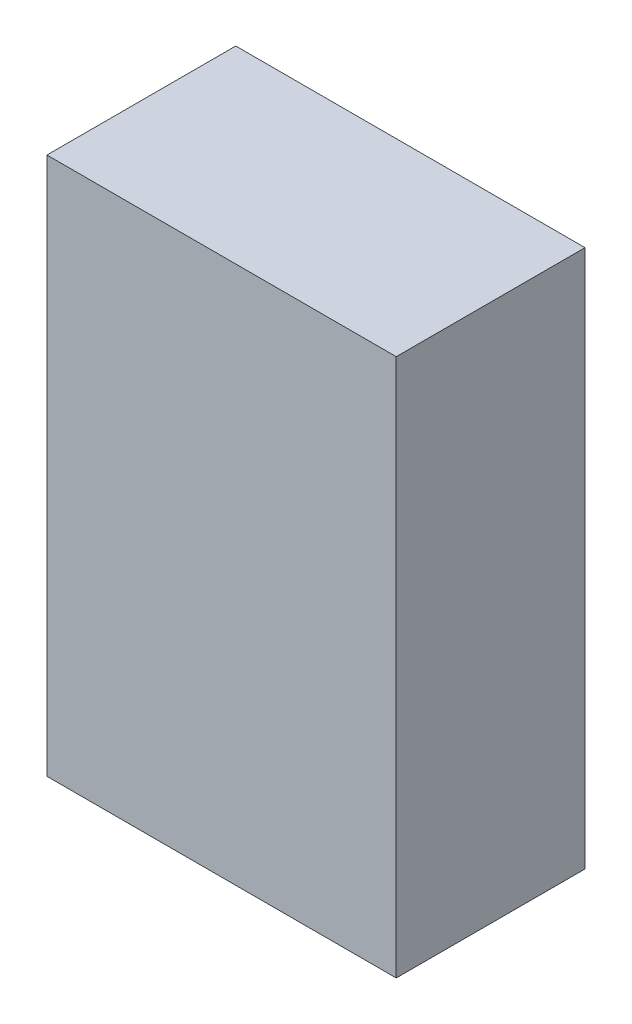
ISO-10303-21;
HEADER;
FILE_DESCRIPTION(('STEP AP214'),'2;1');
FILE_NAME('part.step','',(''),(''),'','','');
FILE_SCHEMA(('AUTOMOTIVE_DESIGN { 1 0 10303 214 1 1 1 1 }'));
ENDSEC;
DATA;
#1=APPLICATION_CONTEXT('core data for automotive mechanical design processes');
#2=APPLICATION_PROTOCOL_DEFINITION('international standard','automotive_design',2000,#1);
#3=PRODUCT_CONTEXT('',#1,'mechanical');
#4=PRODUCT('Part','Part','',(#3));
#5=PRODUCT_RELATED_PRODUCT_CATEGORY('part','',(#4));
#6=PRODUCT_DEFINITION_FORMATION('','',#4);
#7=PRODUCT_DEFINITION_CONTEXT('part definition',#1,'design');
#8=PRODUCT_DEFINITION('design','',#6,#7);
#9=PRODUCT_DEFINITION_SHAPE('','',#8);
#10=(LENGTH_UNIT() NAMED_UNIT(*) SI_UNIT(.MILLI.,.METRE.));
#11=(NAMED_UNIT(*) PLANE_ANGLE_UNIT() SI_UNIT($,.RADIAN.));
#12=(NAMED_UNIT(*) SI_UNIT($,.STERADIAN.) SOLID_ANGLE_UNIT());
#13=UNCERTAINTY_MEASURE_WITH_UNIT(LENGTH_MEASURE(1.E-05),#10,'distance_accuracy_value','');
#14=(GEOMETRIC_REPRESENTATION_CONTEXT(3) GLOBAL_UNCERTAINTY_ASSIGNED_CONTEXT((#13)) GLOBAL_UNIT_ASSIGNED_CONTEXT((#10,
#11,#12)) REPRESENTATION_CONTEXT('',''));
#15=CARTESIAN_POINT('',(0.,0.,0.));
#16=DIRECTION('',(0.,0.,1.));
#17=DIRECTION('',(1.,0.,0.));
#18=AXIS2_PLACEMENT_3D('',#15,#16,#17);
#19=CARTESIAN_POINT('',(-0.55499762,-0.85499956,0.5999988));
#20=DIRECTION('',(0.,0.,-1.));
#21=DIRECTION('',(0.,-1.,0.));
#22=AXIS2_PLACEMENT_3D('',#19,#20,#21);
#23=PLANE('',#22);
#24=DIRECTION('',(1.,0.,0.));
#25=VECTOR('',#24,1.);
#26=CARTESIAN_POINT('',(-0.55499762,-0.85499956,0.5999988));
#27=LINE('',#26,#25);
#28=CARTESIAN_POINT('',(-0.55499762,-0.85499956,0.5999988));
#29=VERTEX_POINT('',#28);
#30=CARTESIAN_POINT('',(0.55499762,-0.85499956,0.5999988));
#31=VERTEX_POINT('',#30);
#32=EDGE_CURVE('E83',#29,#31,#27,.T.);
#33=ORIENTED_EDGE('',*,*,#32,.T.);
#34=DIRECTION('',(0.,1.,0.));
#35=VECTOR('',#34,1.);
#36=CARTESIAN_POINT('',(0.55499762,-0.85499956,0.5999988));
#37=LINE('',#36,#35);
#38=CARTESIAN_POINT('',(0.55499762,0.85499956,0.5999988));
#39=VERTEX_POINT('',#38);
#40=EDGE_CURVE('E107',#31,#39,#37,.T.);
#41=ORIENTED_EDGE('',*,*,#40,.T.);
#42=DIRECTION('',(-1.,0.,0.));
#43=VECTOR('',#42,1.);
#44=CARTESIAN_POINT('',(0.55499762,0.85499956,0.5999988));
#45=LINE('',#44,#43);
#46=CARTESIAN_POINT('',(-0.55499762,0.85499956,0.5999988));
#47=VERTEX_POINT('',#46);
#48=EDGE_CURVE('E20',#39,#47,#45,.T.);
#49=ORIENTED_EDGE('',*,*,#48,.T.);
#50=DIRECTION('',(0.,-1.,0.));
#51=VECTOR('',#50,1.);
#52=CARTESIAN_POINT('',(-0.55499762,0.85499956,0.5999988));
#53=LINE('',#52,#51);
#54=EDGE_CURVE('E11',#47,#29,#53,.T.);
#55=ORIENTED_EDGE('',*,*,#54,.T.);
#56=EDGE_LOOP('',(#33,#41,#49,#55));
#57=FACE_BOUND('',#56,.T.);
#58=ADVANCED_FACE('F17',(#57),#23,.F.);
#59=CARTESIAN_POINT('',(-0.55499762,-0.85499956,0.));
#60=DIRECTION('',(0.,0.,-1.));
#61=DIRECTION('',(0.,-1.,0.));
#62=AXIS2_PLACEMENT_3D('',#59,#60,#61);
#63=PLANE('',#62);
#64=DIRECTION('',(0.,-1.,0.));
#65=VECTOR('',#64,1.);
#66=CARTESIAN_POINT('',(-0.55499762,0.85499956,0.));
#67=LINE('',#66,#65);
#68=CARTESIAN_POINT('',(-0.55499762,0.85499956,0.));
#69=VERTEX_POINT('',#68);
#70=CARTESIAN_POINT('',(-0.55499762,-0.85499956,0.));
#71=VERTEX_POINT('',#70);
#72=EDGE_CURVE('E26',#69,#71,#67,.T.);
#73=ORIENTED_EDGE('',*,*,#72,.F.);
#74=DIRECTION('',(-1.,0.,0.));
#75=VECTOR('',#74,1.);
#76=CARTESIAN_POINT('',(0.55499762,0.85499956,0.));
#77=LINE('',#76,#75);
#78=CARTESIAN_POINT('',(0.55499762,0.85499956,0.));
#79=VERTEX_POINT('',#78);
#80=EDGE_CURVE('E108',#79,#69,#77,.T.);
#81=ORIENTED_EDGE('',*,*,#80,.F.);
#82=DIRECTION('',(0.,1.,0.));
#83=VECTOR('',#82,1.);
#84=CARTESIAN_POINT('',(0.55499762,-0.85499956,0.));
#85=LINE('',#84,#83);
#86=CARTESIAN_POINT('',(0.55499762,-0.85499956,0.));
#87=VERTEX_POINT('',#86);
#88=EDGE_CURVE('E85',#87,#79,#85,.T.);
#89=ORIENTED_EDGE('',*,*,#88,.F.);
#90=DIRECTION('',(1.,0.,0.));
#91=VECTOR('',#90,1.);
#92=CARTESIAN_POINT('',(-0.55499762,-0.85499956,0.));
#93=LINE('',#92,#91);
#94=EDGE_CURVE('E81',#71,#87,#93,.T.);
#95=ORIENTED_EDGE('',*,*,#94,.F.);
#96=EDGE_LOOP('',(#73,#81,#89,#95));
#97=FACE_BOUND('',#96,.T.);
#98=ADVANCED_FACE('F87',(#97),#63,.T.);
#99=CARTESIAN_POINT('',(-0.55499762,0.85499956,0.));
#100=DIRECTION('',(1.,0.,0.));
#101=DIRECTION('',(0.,1.,0.));
#102=AXIS2_PLACEMENT_3D('',#99,#100,#101);
#103=PLANE('',#102);
#104=ORIENTED_EDGE('',*,*,#72,.T.);
#105=DIRECTION('',(0.,0.,1.));
#106=VECTOR('',#105,1.);
#107=CARTESIAN_POINT('',(-0.55499762,-0.85499956,0.));
#108=LINE('',#107,#106);
#109=EDGE_CURVE('E70',#71,#29,#108,.T.);
#110=ORIENTED_EDGE('',*,*,#109,.T.);
#111=ORIENTED_EDGE('',*,*,#54,.F.);
#112=DIRECTION('',(0.,0.,1.));
#113=VECTOR('',#112,1.);
#114=CARTESIAN_POINT('',(-0.55499762,0.85499956,0.));
#115=LINE('',#114,#113);
#116=EDGE_CURVE('E73',#69,#47,#115,.T.);
#117=ORIENTED_EDGE('',*,*,#116,.F.);
#118=EDGE_LOOP('',(#104,#110,#111,#117));
#119=FACE_BOUND('',#118,.T.);
#120=ADVANCED_FACE('F69',(#119),#103,.F.);
#121=CARTESIAN_POINT('',(0.55499762,0.85499956,0.));
#122=DIRECTION('',(0.,-1.,0.));
#123=DIRECTION('',(0.,0.,-1.));
#124=AXIS2_PLACEMENT_3D('',#121,#122,#123);
#125=PLANE('',#124);
#126=ORIENTED_EDGE('',*,*,#80,.T.);
#127=ORIENTED_EDGE('',*,*,#116,.T.);
#128=ORIENTED_EDGE('',*,*,#48,.F.);
#129=DIRECTION('',(0.,0.,1.));
#130=VECTOR('',#129,1.);
#131=CARTESIAN_POINT('',(0.55499762,0.85499956,0.));
#132=LINE('',#131,#130);
#133=EDGE_CURVE('E103',#79,#39,#132,.T.);
#134=ORIENTED_EDGE('',*,*,#133,.F.);
#135=EDGE_LOOP('',(#126,#127,#128,#134));
#136=FACE_BOUND('',#135,.T.);
#137=ADVANCED_FACE('F122',(#136),#125,.F.);
#138=CARTESIAN_POINT('',(0.55499762,-0.85499956,0.));
#139=DIRECTION('',(-1.,0.,0.));
#140=DIRECTION('',(0.,0.,1.));
#141=AXIS2_PLACEMENT_3D('',#138,#139,#140);
#142=PLANE('',#141);
#143=ORIENTED_EDGE('',*,*,#88,.T.);
#144=ORIENTED_EDGE('',*,*,#133,.T.);
#145=ORIENTED_EDGE('',*,*,#40,.F.);
#146=DIRECTION('',(0.,0.,1.));
#147=VECTOR('',#146,1.);
#148=CARTESIAN_POINT('',(0.55499762,-0.85499956,0.));
#149=LINE('',#148,#147);
#150=EDGE_CURVE('E91',#87,#31,#149,.T.);
#151=ORIENTED_EDGE('',*,*,#150,.F.);
#152=EDGE_LOOP('',(#143,#144,#145,#151));
#153=FACE_BOUND('',#152,.T.);
#154=ADVANCED_FACE('F124',(#153),#142,.F.);
#155=CARTESIAN_POINT('',(-0.55499762,-0.85499956,0.));
#156=DIRECTION('',(0.,1.,0.));
#157=DIRECTION('',(1.,0.,0.));
#158=AXIS2_PLACEMENT_3D('',#155,#156,#157);
#159=PLANE('',#158);
#160=ORIENTED_EDGE('',*,*,#94,.T.);
#161=ORIENTED_EDGE('',*,*,#150,.T.);
#162=ORIENTED_EDGE('',*,*,#32,.F.);
#163=ORIENTED_EDGE('',*,*,#109,.F.);
#164=EDGE_LOOP('',(#160,#161,#162,#163));
#165=FACE_BOUND('',#164,.T.);
#166=ADVANCED_FACE('F79',(#165),#159,.F.);
#167=CLOSED_SHELL('',(#58,#98,#120,#137,#154,#166));
#168=MANIFOLD_SOLID_BREP('B1',#167);
#169=ADVANCED_BREP_SHAPE_REPRESENTATION('',(#18,#168),#14);
#170=SHAPE_DEFINITION_REPRESENTATION(#9,#169);
ENDSEC;
END-ISO-10303-21;
